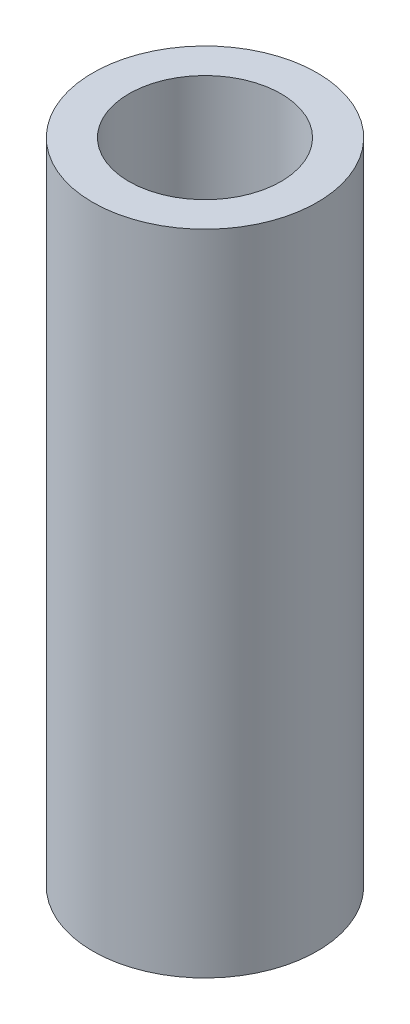
ISO-10303-21;
HEADER;
FILE_DESCRIPTION(('STEP AP214'),'2;1');
FILE_NAME('part.step','',(''),(''),'','','');
FILE_SCHEMA(('AUTOMOTIVE_DESIGN { 1 0 10303 214 1 1 1 1 }'));
ENDSEC;
DATA;
#1=APPLICATION_CONTEXT('core data for automotive mechanical design processes');
#2=APPLICATION_PROTOCOL_DEFINITION('international standard','automotive_design',2000,#1);
#3=PRODUCT_CONTEXT('',#1,'mechanical');
#4=PRODUCT('Part','Part','',(#3));
#5=PRODUCT_RELATED_PRODUCT_CATEGORY('part','',(#4));
#6=PRODUCT_DEFINITION_FORMATION('','',#4);
#7=PRODUCT_DEFINITION_CONTEXT('part definition',#1,'design');
#8=PRODUCT_DEFINITION('design','',#6,#7);
#9=PRODUCT_DEFINITION_SHAPE('','',#8);
#10=(LENGTH_UNIT() NAMED_UNIT(*) SI_UNIT(.MILLI.,.METRE.));
#11=(NAMED_UNIT(*) PLANE_ANGLE_UNIT() SI_UNIT($,.RADIAN.));
#12=(NAMED_UNIT(*) SI_UNIT($,.STERADIAN.) SOLID_ANGLE_UNIT());
#13=UNCERTAINTY_MEASURE_WITH_UNIT(LENGTH_MEASURE(1.E-05),#10,'distance_accuracy_value','');
#14=(GEOMETRIC_REPRESENTATION_CONTEXT(3) GLOBAL_UNCERTAINTY_ASSIGNED_CONTEXT((#13)) GLOBAL_UNIT_ASSIGNED_CONTEXT((#10,
#11,#12)) REPRESENTATION_CONTEXT('',''));
#15=CARTESIAN_POINT('',(0.,0.,0.));
#16=DIRECTION('',(0.,0.,1.));
#17=DIRECTION('',(1.,0.,0.));
#18=AXIS2_PLACEMENT_3D('',#15,#16,#17);
#19=CARTESIAN_POINT('',(0.,58.5381165593623,0.));
#20=DIRECTION('',(0.,1.,0.));
#21=DIRECTION('',(0.,0.,1.));
#22=AXIS2_PLACEMENT_3D('',#19,#20,#21);
#23=CYLINDRICAL_SURFACE('',#22,4.49999999999999);
#24=CARTESIAN_POINT('',(0.,-30.8016925534631,0.));
#25=DIRECTION('',(0.,1.,0.));
#26=DIRECTION('',(0.,0.,1.));
#27=AXIS2_PLACEMENT_3D('',#24,#25,#26);
#28=CIRCLE('',#27,4.49999999999999);
#29=CARTESIAN_POINT('',(0.,-30.8016925534631,4.49999999999999));
#30=VERTEX_POINT('',#29);
#31=EDGE_CURVE('E10',#30,#30,#28,.T.);
#32=ORIENTED_EDGE('',*,*,#31,.T.);
#33=EDGE_LOOP('',(#32));
#34=FACE_BOUND('',#33,.T.);
#35=CARTESIAN_POINT('',(0.,-4.8016925534631,0.));
#36=DIRECTION('',(0.,1.,0.));
#37=DIRECTION('',(0.,0.,1.));
#38=AXIS2_PLACEMENT_3D('',#35,#36,#37);
#39=CIRCLE('',#38,4.49999999999999);
#40=CARTESIAN_POINT('',(0.,-4.8016925534631,4.49999999999999));
#41=VERTEX_POINT('',#40);
#42=EDGE_CURVE('E44',#41,#41,#39,.T.);
#43=ORIENTED_EDGE('',*,*,#42,.F.);
#44=EDGE_LOOP('',(#43));
#45=FACE_BOUND('',#44,.T.);
#46=ADVANCED_FACE('F30',(#34,#45),#23,.T.);
#47=CARTESIAN_POINT('',(-3.04999999999999,-30.8016925534631,0.));
#48=DIRECTION('',(0.,-1.,0.));
#49=DIRECTION('',(0.,0.,-1.));
#50=AXIS2_PLACEMENT_3D('',#47,#48,#49);
#51=PLANE('',#50);
#52=CARTESIAN_POINT('',(0.,-30.8016925534631,0.));
#53=DIRECTION('',(0.,1.,0.));
#54=DIRECTION('',(0.,0.,1.));
#55=AXIS2_PLACEMENT_3D('',#52,#53,#54);
#56=CIRCLE('',#55,3.04999999999999);
#57=CARTESIAN_POINT('',(0.,-30.8016925534631,3.04999999999999));
#58=VERTEX_POINT('',#57);
#59=EDGE_CURVE('E36',#58,#58,#56,.T.);
#60=ORIENTED_EDGE('',*,*,#59,.T.);
#61=EDGE_LOOP('',(#60));
#62=FACE_BOUND('',#61,.T.);
#63=ORIENTED_EDGE('',*,*,#31,.F.);
#64=EDGE_LOOP('',(#63));
#65=FACE_BOUND('',#64,.T.);
#66=ADVANCED_FACE('F54',(#62,#65),#51,.T.);
#67=CARTESIAN_POINT('',(0.,58.5381165593623,0.));
#68=DIRECTION('',(0.,1.,0.));
#69=DIRECTION('',(0.,0.,1.));
#70=AXIS2_PLACEMENT_3D('',#67,#68,#69);
#71=CYLINDRICAL_SURFACE('',#70,3.04999999999999);
#72=CARTESIAN_POINT('',(0.,-4.8016925534631,0.));
#73=DIRECTION('',(0.,1.,0.));
#74=DIRECTION('',(0.,0.,1.));
#75=AXIS2_PLACEMENT_3D('',#72,#73,#74);
#76=CIRCLE('',#75,3.04999999999999);
#77=CARTESIAN_POINT('',(0.,-4.8016925534631,3.04999999999999));
#78=VERTEX_POINT('',#77);
#79=EDGE_CURVE('E40',#78,#78,#76,.T.);
#80=ORIENTED_EDGE('',*,*,#79,.T.);
#81=EDGE_LOOP('',(#80));
#82=FACE_BOUND('',#81,.T.);
#83=ORIENTED_EDGE('',*,*,#59,.F.);
#84=EDGE_LOOP('',(#83));
#85=FACE_BOUND('',#84,.T.);
#86=ADVANCED_FACE('F58',(#82,#85),#71,.F.);
#87=CARTESIAN_POINT('',(-3.04999999999999,-4.8016925534631,0.));
#88=DIRECTION('',(0.,1.,0.));
#89=DIRECTION('',(0.,0.,1.));
#90=AXIS2_PLACEMENT_3D('',#87,#88,#89);
#91=PLANE('',#90);
#92=ORIENTED_EDGE('',*,*,#42,.T.);
#93=EDGE_LOOP('',(#92));
#94=FACE_BOUND('',#93,.T.);
#95=ORIENTED_EDGE('',*,*,#79,.F.);
#96=EDGE_LOOP('',(#95));
#97=FACE_BOUND('',#96,.T.);
#98=ADVANCED_FACE('F50',(#94,#97),#91,.T.);
#99=CLOSED_SHELL('',(#46,#66,#86,#98));
#100=MANIFOLD_SOLID_BREP('B2',#99);
#101=ADVANCED_BREP_SHAPE_REPRESENTATION('',(#18,#100),#14);
#102=SHAPE_DEFINITION_REPRESENTATION(#9,#101);
ENDSEC;
END-ISO-10303-21;
